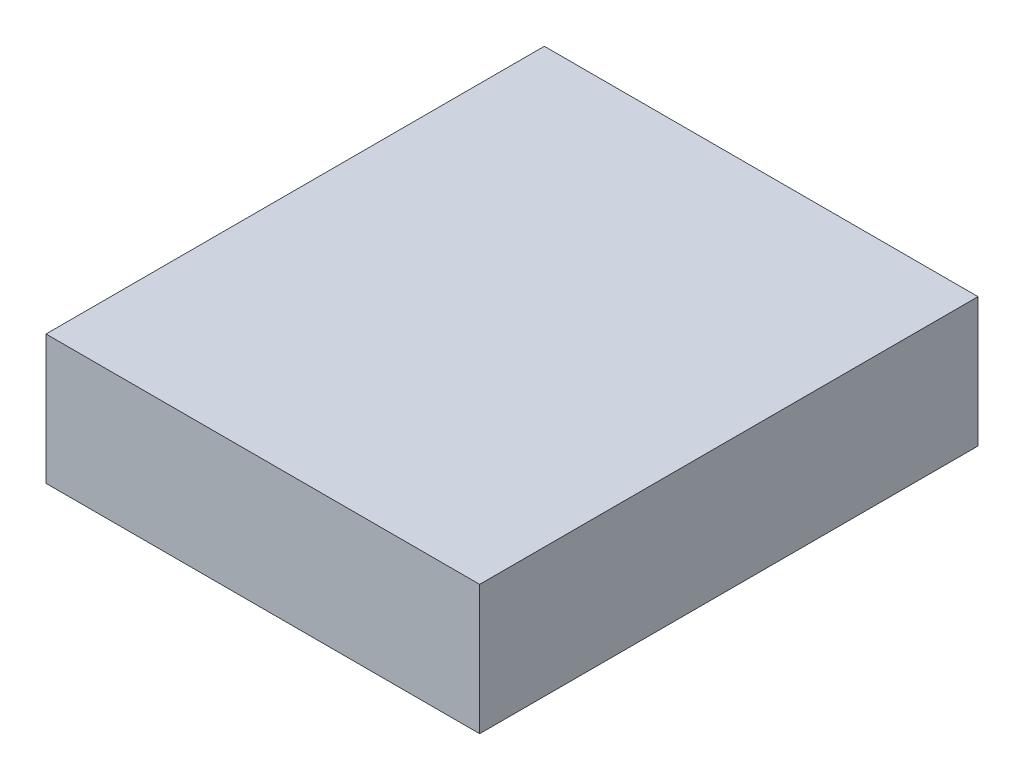
ISO-10303-21;
HEADER;
FILE_DESCRIPTION(('STEP AP214'),'2;1');
FILE_NAME('part.step','',(''),(''),'','','');
FILE_SCHEMA(('AUTOMOTIVE_DESIGN { 1 0 10303 214 1 1 1 1 }'));
ENDSEC;
DATA;
#1=APPLICATION_CONTEXT('core data for automotive mechanical design processes');
#2=APPLICATION_PROTOCOL_DEFINITION('international standard','automotive_design',2000,#1);
#3=PRODUCT_CONTEXT('',#1,'mechanical');
#4=PRODUCT('Part','Part','',(#3));
#5=PRODUCT_RELATED_PRODUCT_CATEGORY('part','',(#4));
#6=PRODUCT_DEFINITION_FORMATION('','',#4);
#7=PRODUCT_DEFINITION_CONTEXT('part definition',#1,'design');
#8=PRODUCT_DEFINITION('design','',#6,#7);
#9=PRODUCT_DEFINITION_SHAPE('','',#8);
#10=(LENGTH_UNIT() NAMED_UNIT(*) SI_UNIT(.MILLI.,.METRE.));
#11=(NAMED_UNIT(*) PLANE_ANGLE_UNIT() SI_UNIT($,.RADIAN.));
#12=(NAMED_UNIT(*) SI_UNIT($,.STERADIAN.) SOLID_ANGLE_UNIT());
#13=UNCERTAINTY_MEASURE_WITH_UNIT(LENGTH_MEASURE(1.E-05),#10,'distance_accuracy_value','');
#14=(GEOMETRIC_REPRESENTATION_CONTEXT(3) GLOBAL_UNCERTAINTY_ASSIGNED_CONTEXT((#13)) GLOBAL_UNIT_ASSIGNED_CONTEXT((#10,
#11,#12)) REPRESENTATION_CONTEXT('',''));
#15=CARTESIAN_POINT('',(0.,0.,0.));
#16=DIRECTION('',(0.,0.,1.));
#17=DIRECTION('',(1.,0.,0.));
#18=AXIS2_PLACEMENT_3D('',#15,#16,#17);
#19=CARTESIAN_POINT('',(49.1336556451419,20.,-2.39991494934085));
#20=DIRECTION('',(1.,0.,0.));
#21=DIRECTION('',(0.,0.,-1.));
#22=AXIS2_PLACEMENT_3D('',#19,#20,#21);
#23=PLANE('',#22);
#24=DIRECTION('',(0.,0.,1.));
#25=VECTOR('',#24,1.);
#26=CARTESIAN_POINT('',(49.1336556451419,30.,-2.39991494934085));
#27=LINE('',#26,#25);
#28=CARTESIAN_POINT('',(49.1336556451419,30.,-79.4472188450339));
#29=VERTEX_POINT('',#28);
#30=CARTESIAN_POINT('',(49.1336556451419,30.,-2.39991494934085));
#31=VERTEX_POINT('',#30);
#32=EDGE_CURVE('E128',#29,#31,#27,.T.);
#33=ORIENTED_EDGE('',*,*,#32,.F.);
#34=DIRECTION('',(0.,1.,0.));
#35=VECTOR('',#34,1.);
#36=CARTESIAN_POINT('',(49.1336556451419,20.,-79.4472188450339));
#37=LINE('',#36,#35);
#38=CARTESIAN_POINT('',(49.1336556451419,50.,-79.4472188450339));
#39=VERTEX_POINT('',#38);
#40=EDGE_CURVE('E256',#29,#39,#37,.T.);
#41=ORIENTED_EDGE('',*,*,#40,.T.);
#42=DIRECTION('',(0.,0.,-1.));
#43=VECTOR('',#42,1.);
#44=CARTESIAN_POINT('',(49.1336556451419,50.,-2.39991494934085));
#45=LINE('',#44,#43);
#46=CARTESIAN_POINT('',(49.1336556451419,50.,-2.39991494934085));
#47=VERTEX_POINT('',#46);
#48=EDGE_CURVE('E289',#47,#39,#45,.T.);
#49=ORIENTED_EDGE('',*,*,#48,.F.);
#50=DIRECTION('',(0.,1.,0.));
#51=VECTOR('',#50,1.);
#52=CARTESIAN_POINT('',(49.1336556451419,20.,-2.39991494934085));
#53=LINE('',#52,#51);
#54=EDGE_CURVE('E260',#31,#47,#53,.T.);
#55=ORIENTED_EDGE('',*,*,#54,.F.);
#56=EDGE_LOOP('',(#33,#41,#49,#55));
#57=FACE_BOUND('',#56,.T.);
#58=ADVANCED_FACE('F40',(#57),#23,.T.);
#59=CARTESIAN_POINT('',(49.1336556451419,20.,-2.39991494934085));
#60=DIRECTION('',(0.,0.,1.));
#61=DIRECTION('',(1.,0.,0.));
#62=AXIS2_PLACEMENT_3D('',#59,#60,#61);
#63=PLANE('',#62);
#64=DIRECTION('',(-1.,0.,0.));
#65=VECTOR('',#64,1.);
#66=CARTESIAN_POINT('',(49.1336556451419,30.,-2.39991494934085));
#67=LINE('',#66,#65);
#68=CARTESIAN_POINT('',(-17.9136482505511,30.,-2.39991494934084));
#69=VERTEX_POINT('',#68);
#70=EDGE_CURVE('E265',#31,#69,#67,.T.);
#71=ORIENTED_EDGE('',*,*,#70,.F.);
#72=ORIENTED_EDGE('',*,*,#54,.T.);
#73=DIRECTION('',(1.,0.,0.));
#74=VECTOR('',#73,1.);
#75=CARTESIAN_POINT('',(49.1336556451419,50.,-2.39991494934085));
#76=LINE('',#75,#74);
#77=CARTESIAN_POINT('',(-17.9136482505511,50.,-2.39991494934084));
#78=VERTEX_POINT('',#77);
#79=EDGE_CURVE('E275',#78,#47,#76,.T.);
#80=ORIENTED_EDGE('',*,*,#79,.F.);
#81=DIRECTION('',(0.,1.,0.));
#82=VECTOR('',#81,1.);
#83=CARTESIAN_POINT('',(-17.9136482505511,20.,-2.39991494934084));
#84=LINE('',#83,#82);
#85=EDGE_CURVE('E276',#69,#78,#84,.T.);
#86=ORIENTED_EDGE('',*,*,#85,.F.);
#87=EDGE_LOOP('',(#71,#72,#80,#86));
#88=FACE_BOUND('',#87,.T.);
#89=ADVANCED_FACE('F240',(#88),#63,.T.);
#90=CARTESIAN_POINT('',(-17.9136482505511,20.,-2.39991494934084));
#91=DIRECTION('',(-1.,0.,0.));
#92=DIRECTION('',(0.,0.,1.));
#93=AXIS2_PLACEMENT_3D('',#90,#91,#92);
#94=PLANE('',#93);
#95=DIRECTION('',(0.,0.,-1.));
#96=VECTOR('',#95,1.);
#97=CARTESIAN_POINT('',(-17.9136482505511,30.,-2.39991494934084));
#98=LINE('',#97,#96);
#99=CARTESIAN_POINT('',(-17.9136482505511,30.,-79.4472188450339));
#100=VERTEX_POINT('',#99);
#101=EDGE_CURVE('E284',#69,#100,#98,.T.);
#102=ORIENTED_EDGE('',*,*,#101,.F.);
#103=ORIENTED_EDGE('',*,*,#85,.T.);
#104=DIRECTION('',(0.,0.,1.));
#105=VECTOR('',#104,1.);
#106=CARTESIAN_POINT('',(-17.9136482505511,50.,-2.39991494934084));
#107=LINE('',#106,#105);
#108=CARTESIAN_POINT('',(-17.9136482505511,50.,-79.4472188450339));
#109=VERTEX_POINT('',#108);
#110=EDGE_CURVE('E279',#109,#78,#107,.T.);
#111=ORIENTED_EDGE('',*,*,#110,.F.);
#112=DIRECTION('',(0.,1.,0.));
#113=VECTOR('',#112,1.);
#114=CARTESIAN_POINT('',(-17.9136482505511,20.,-79.4472188450339));
#115=LINE('',#114,#113);
#116=EDGE_CURVE('E274',#100,#109,#115,.T.);
#117=ORIENTED_EDGE('',*,*,#116,.F.);
#118=EDGE_LOOP('',(#102,#103,#111,#117));
#119=FACE_BOUND('',#118,.T.);
#120=ADVANCED_FACE('F245',(#119),#94,.T.);
#121=CARTESIAN_POINT('',(49.1336556451419,20.,-79.4472188450339));
#122=DIRECTION('',(0.,0.,-1.));
#123=DIRECTION('',(-1.,0.,0.));
#124=AXIS2_PLACEMENT_3D('',#121,#122,#123);
#125=PLANE('',#124);
#126=DIRECTION('',(1.,0.,0.));
#127=VECTOR('',#126,1.);
#128=CARTESIAN_POINT('',(49.1336556451419,30.,-79.4472188450339));
#129=LINE('',#128,#127);
#130=EDGE_CURVE('E43',#100,#29,#129,.T.);
#131=ORIENTED_EDGE('',*,*,#130,.F.);
#132=ORIENTED_EDGE('',*,*,#116,.T.);
#133=DIRECTION('',(-1.,0.,0.));
#134=VECTOR('',#133,1.);
#135=CARTESIAN_POINT('',(49.1336556451419,50.,-79.4472188450339));
#136=LINE('',#135,#134);
#137=EDGE_CURVE('E272',#39,#109,#136,.T.);
#138=ORIENTED_EDGE('',*,*,#137,.F.);
#139=ORIENTED_EDGE('',*,*,#40,.F.);
#140=EDGE_LOOP('',(#131,#132,#138,#139));
#141=FACE_BOUND('',#140,.T.);
#142=ADVANCED_FACE('F269',(#141),#125,.T.);
#143=CARTESIAN_POINT('',(0.,50.,0.));
#144=DIRECTION('',(0.,1.,0.));
#145=DIRECTION('',(0.,0.,1.));
#146=AXIS2_PLACEMENT_3D('',#143,#144,#145);
#147=PLANE('',#146);
#148=ORIENTED_EDGE('',*,*,#48,.T.);
#149=ORIENTED_EDGE('',*,*,#137,.T.);
#150=ORIENTED_EDGE('',*,*,#110,.T.);
#151=ORIENTED_EDGE('',*,*,#79,.T.);
#152=EDGE_LOOP('',(#148,#149,#150,#151));
#153=FACE_BOUND('',#152,.T.);
#154=ADVANCED_FACE('F146',(#153),#147,.T.);
#155=CARTESIAN_POINT('',(-6.91319126641939,40.,-68.4467618609022));
#156=DIRECTION('',(0.,1.,0.));
#157=DIRECTION('',(0.,0.,1.));
#158=AXIS2_PLACEMENT_3D('',#155,#156,#157);
#159=PLANE('',#158);
#160=CARTESIAN_POINT('',(-6.91410516507951,40.,-71.2726681957517));
#161=CARTESIAN_POINT('',(-6.99350375653562,40.,-71.2726683552427));
#162=CARTESIAN_POINT('',(-7.0728961964871,40.,-71.269280741278));
#163=CARTESIAN_POINT('',(-7.23111983019565,40.,-71.2558372766086));
#164=CARTESIAN_POINT('',(-7.30995099225767,40.,-71.2457810523026));
#165=CARTESIAN_POINT('',(-7.46643169742658,40.,-71.2191183349682));
#166=CARTESIAN_POINT('',(-7.54408213255943,40.,-71.2025170710676));
#167=CARTESIAN_POINT('',(-7.69771895369474,40.,-71.1628767594028));
#168=CARTESIAN_POINT('',(-7.77370542838461,40.,-71.1398380556527));
#169=CARTESIAN_POINT('',(-7.92350714506879,40.,-71.0874022796631));
#170=CARTESIAN_POINT('',(-7.99732101346979,40.,-71.0580012790652));
#171=CARTESIAN_POINT('',(-8.14218310243329,40.,-70.9930296777464));
#172=CARTESIAN_POINT('',(-8.21323123096199,40.,-70.9574588719312));
#173=CARTESIAN_POINT('',(-8.35207830370206,40.,-70.8804937852592));
#174=CARTESIAN_POINT('',(-8.41987792137057,40.,-70.8391007184946));
#175=CARTESIAN_POINT('',(-8.55177748489108,40.,-70.7507890609137));
#176=CARTESIAN_POINT('',(-8.61587743128826,40.,-70.7038704709115));
#177=CARTESIAN_POINT('',(-8.73995589691335,40.,-70.6047919985234));
#178=CARTESIAN_POINT('',(-8.79993193230457,40.,-70.5526290031919));
#179=CARTESIAN_POINT('',(-8.91522609834722,40.,-70.4433909556665));
#180=CARTESIAN_POINT('',(-8.97054437858841,40.,-70.3863160613437));
#181=CARTESIAN_POINT('',(-9.07616225198287,40.,-70.2676772092499));
#182=CARTESIAN_POINT('',(-9.12646106272319,40.,-70.2061125542153));
#183=CARTESIAN_POINT('',(-9.22171769602281,40.,-70.0790044497301));
#184=CARTESIAN_POINT('',(-9.26667525401092,40.,-70.0134608034287));
#185=CARTESIAN_POINT('',(-9.39299296003701,40.,-69.8116418723348));
#186=CARTESIAN_POINT('',(-9.46597662208457,40.,-69.669977455296));
#187=CARTESIAN_POINT('',(-9.5868123551977,40.,-69.3764361164516));
#188=CARTESIAN_POINT('',(-9.63467860398487,40.,-69.2245650106258));
#189=CARTESIAN_POINT('',(-9.69261081629481,40.,-68.9677744729264));
#190=CARTESIAN_POINT('',(-9.7099955434211,40.,-68.8644478250843));
#191=CARTESIAN_POINT('',(-9.73322697683256,40.,-68.6566573635956));
#192=CARTESIAN_POINT('',(-9.73909019551389,40.,-68.5521953934485));
#193=CARTESIAN_POINT('',(-9.73909760126894,40.,-68.4476757595647));
#194=B_SPLINE_CURVE_WITH_KNOTS('',3,(#160,#161,#162,#163,#164,#165,#166,#167,#168,#169,#170,
#171,#172,#173,#174,#175,#176,#177,#178,#179,#180,#181,#182,#183,#184,#185,#186,#187,#188,#189,
#190,#191,#192,#193),.UNSPECIFIED.,.F.,.F.,(4,2,2,2,2,2,2,2,2,2,2,2,2,2,2,2,4),(0.,
0.238115313632897,0.476243968530402,0.714182755981982,0.952108830517508,1.19018223225549,
1.42826354945232,1.66629529392513,1.90432700332236,2.14250084593794,2.38066703637684,
2.6188702933212,2.85708534440264,3.33271868177486,3.8080832545841,4.12182342241765,
4.43511361520378),.UNSPECIFIED.);
#195=CARTESIAN_POINT('',(-6.91410516507951,40.,-71.2726681957517));
#196=VERTEX_POINT('',#195);
#197=CARTESIAN_POINT('',(-9.73909760126893,40.,-68.4476757595647));
#198=VERTEX_POINT('',#197);
#199=EDGE_CURVE('E109',#196,#198,#194,.T.);
#200=ORIENTED_EDGE('',*,*,#199,.F.);
#201=DIRECTION('',(1.,0.,0.));
#202=VECTOR('',#201,1.);
#203=CARTESIAN_POINT('',(38.1341125596728,40.,-71.2726681957517));
#204=LINE('',#203,#202);
#205=CARTESIAN_POINT('',(38.1341125596728,40.,-71.2726681957517));
#206=VERTEX_POINT('',#205);
#207=EDGE_CURVE('E104',#206,#196,#204,.F.);
#208=ORIENTED_EDGE('',*,*,#207,.F.);
#209=CARTESIAN_POINT('',(40.9591049958598,40.,-68.4476757595629));
#210=CARTESIAN_POINT('',(40.9591051553509,40.,-68.5270743510192));
#211=CARTESIAN_POINT('',(40.9557175413862,40.,-68.6064667909708));
#212=CARTESIAN_POINT('',(40.9422740767167,40.,-68.7646904246797));
#213=CARTESIAN_POINT('',(40.9322178524107,40.,-68.8435215867418));
#214=CARTESIAN_POINT('',(40.9055551350761,40.,-69.0000022919111));
#215=CARTESIAN_POINT('',(40.8889538711753,40.,-69.0776527270442));
#216=CARTESIAN_POINT('',(40.8493135595101,40.,-69.2312895481799));
#217=CARTESIAN_POINT('',(40.8262748557598,40.,-69.30727602287));
#218=CARTESIAN_POINT('',(40.7738390797699,40.,-69.4570777395546));
#219=CARTESIAN_POINT('',(40.7444380791719,40.,-69.5308916079558));
#220=CARTESIAN_POINT('',(40.679466477853,40.,-69.6757536969197));
#221=CARTESIAN_POINT('',(40.6438956720378,40.,-69.7468018254486));
#222=CARTESIAN_POINT('',(40.5669305853658,40.,-69.885648898189));
#223=CARTESIAN_POINT('',(40.5255375186011,40.,-69.9534485158577));
#224=CARTESIAN_POINT('',(40.4372258610199,40.,-70.0853480793784));
#225=CARTESIAN_POINT('',(40.3903072710176,40.,-70.1494480257756));
#226=CARTESIAN_POINT('',(40.2912287986292,40.,-70.2735264914003));
#227=CARTESIAN_POINT('',(40.2390658032976,40.,-70.333502526791));
#228=CARTESIAN_POINT('',(40.129827755772,40.,-70.4487966928326));
#229=CARTESIAN_POINT('',(40.072752861449,40.,-70.5041149730733));
#230=CARTESIAN_POINT('',(39.9541140093551,40.,-70.6097328464667));
#231=CARTESIAN_POINT('',(39.8925493543204,40.,-70.6600316572066));
#232=CARTESIAN_POINT('',(39.7654412498354,40.,-70.7552882905056));
#233=CARTESIAN_POINT('',(39.6998976035341,40.,-70.8002458484935));
#234=CARTESIAN_POINT('',(39.4980786724396,40.,-70.9265635545201));
#235=CARTESIAN_POINT('',(39.3564142554003,40.,-70.9995472165688));
#236=CARTESIAN_POINT('',(39.0628729165542,40.,-71.1203829496829));
#237=CARTESIAN_POINT('',(38.9110018107274,40.,-71.1682491984699));
#238=CARTESIAN_POINT('',(38.6542112730281,40.,-71.2261814107785));
#239=CARTESIAN_POINT('',(38.5508846251873,40.,-71.2435661379041));
#240=CARTESIAN_POINT('',(38.3430941637011,40.,-71.2667975713148));
#241=CARTESIAN_POINT('',(38.2386321935552,40.,-71.2726607899961));
#242=CARTESIAN_POINT('',(38.1341125596728,40.,-71.2726681957517));
#243=B_SPLINE_CURVE_WITH_KNOTS('',3,(#209,#210,#211,#212,#213,#214,#215,#216,#217,#218,#219,
#220,#221,#222,#223,#224,#225,#226,#227,#228,#229,#230,#231,#232,#233,#234,#235,#236,#237,#238,
#239,#240,#241,#242),.UNSPECIFIED.,.F.,.F.,(4,2,2,2,2,2,2,2,2,2,2,2,2,2,2,2,4),(0.,
0.238115313633369,0.476243968531274,0.714182755983631,0.952108830519971,1.19018223225857,
1.428263549456,1.66629529392926,1.9043270033269,2.1425008459416,2.38066703637962,
2.61887029332326,2.857085344404,3.33271868177922,3.8080832545911,4.12182342242062,
4.43511361520303),.UNSPECIFIED.);
#244=CARTESIAN_POINT('',(40.9591049958598,40.,-68.4476757595629));
#245=VERTEX_POINT('',#244);
#246=EDGE_CURVE('E118',#245,#206,#243,.T.);
#247=ORIENTED_EDGE('',*,*,#246,.F.);
#248=DIRECTION('',(0.,0.,1.));
#249=VECTOR('',#248,1.);
#250=CARTESIAN_POINT('',(40.9591049958598,40.,-13.39945803481));
#251=LINE('',#250,#249);
#252=CARTESIAN_POINT('',(40.9591049958598,40.,-13.39945803481));
#253=VERTEX_POINT('',#252);
#254=EDGE_CURVE('E173',#253,#245,#251,.F.);
#255=ORIENTED_EDGE('',*,*,#254,.F.);
#256=CARTESIAN_POINT('',(38.1341125596713,40.,-10.574465598623));
#257=CARTESIAN_POINT('',(38.2135111511261,40.,-10.5744654391313));
#258=CARTESIAN_POINT('',(38.2929035910764,40.,-10.5778530530955));
#259=CARTESIAN_POINT('',(38.4511272247825,40.,-10.5912965177641));
#260=CARTESIAN_POINT('',(38.5299583868433,40.,-10.6013527420697));
#261=CARTESIAN_POINT('',(38.6864390920098,40.,-10.6280154594034));
#262=CARTESIAN_POINT('',(38.7640895271414,40.,-10.6446167233037));
#263=CARTESIAN_POINT('',(38.9177263482743,40.,-10.6842570349677));
#264=CARTESIAN_POINT('',(38.993712822963,40.,-10.7072957387174));
#265=CARTESIAN_POINT('',(39.1435145396447,40.,-10.7597315147058));
#266=CARTESIAN_POINT('',(39.2173284080444,40.,-10.7891325153029));
#267=CARTESIAN_POINT('',(39.3621904970056,40.,-10.8541041166197));
#268=CARTESIAN_POINT('',(39.4332386255333,40.,-10.8896749224337));
#269=CARTESIAN_POINT('',(39.5720856982715,40.,-10.9666400091031));
#270=CARTESIAN_POINT('',(39.6398853159392,40.,-11.0080330758662));
#271=CARTESIAN_POINT('',(39.7717848794582,40.,-11.0963447334441));
#272=CARTESIAN_POINT('',(39.8358848258548,40.,-11.1432633234447));
#273=CARTESIAN_POINT('',(39.9599632914806,40.,-11.242341795831));
#274=CARTESIAN_POINT('',(40.019939326873,40.,-11.2945047911624));
#275=CARTESIAN_POINT('',(40.135233492918,40.,-11.403742838688));
#276=CARTESIAN_POINT('',(40.1905517731602,40.,-11.460817733011));
#277=CARTESIAN_POINT('',(40.2961696465568,40.,-11.5794565851052));
#278=CARTESIAN_POINT('',(40.3464684572982,40.,-11.6410212401401));
#279=CARTESIAN_POINT('',(40.4417250905998,40.,-11.768129344626));
#280=CARTESIAN_POINT('',(40.486682648589,40.,-11.8336729909277));
#281=CARTESIAN_POINT('',(40.6130003546171,40.,-12.0354919220215));
#282=CARTESIAN_POINT('',(40.6859840166661,40.,-12.1771563390594));
#283=CARTESIAN_POINT('',(40.8068197497816,40.,-12.4706976779029));
#284=CARTESIAN_POINT('',(40.8546859985697,40.,-12.6225687837284));
#285=CARTESIAN_POINT('',(40.9126182108819,40.,-12.8793593214309));
#286=CARTESIAN_POINT('',(40.9300029380093,40.,-12.9826859692764));
#287=CARTESIAN_POINT('',(40.9532343714223,40.,-13.1904764307721));
#288=CARTESIAN_POINT('',(40.9590975901042,40.,-13.2949384009227));
#289=CARTESIAN_POINT('',(40.9591049958598,40.,-13.39945803481));
#290=B_SPLINE_CURVE_WITH_KNOTS('',3,(#256,#257,#258,#259,#260,#261,#262,#263,#264,#265,#266,
#267,#268,#269,#270,#271,#272,#273,#274,#275,#276,#277,#278,#279,#280,#281,#282,#283,#284,#285,
#286,#287,#288,#289),.UNSPECIFIED.,.F.,.F.,(4,2,2,2,2,2,2,2,2,2,2,2,2,2,2,2,4),(0.,
0.238115313629191,0.476243968522861,0.714182755970647,0.952108830502411,1.19018223223602,
1.42826354942849,1.66629529389697,1.90432700328985,2.14250084590806,2.38066703634959,
2.61887029329659,2.85708534438068,3.33271868175286,3.80808325456203,4.1218234224062,
4.43511361520301),.UNSPECIFIED.);
#291=CARTESIAN_POINT('',(38.1341125596713,40.,-10.574465598623));
#292=VERTEX_POINT('',#291);
#293=EDGE_CURVE('E165',#292,#253,#290,.T.);
#294=ORIENTED_EDGE('',*,*,#293,.F.);
#295=DIRECTION('',(-1.,0.,0.));
#296=VECTOR('',#295,1.);
#297=CARTESIAN_POINT('',(-6.91410516508194,40.,-10.574465598623));
#298=LINE('',#297,#296);
#299=CARTESIAN_POINT('',(-6.91410516508194,40.,-10.574465598623));
#300=VERTEX_POINT('',#299);
#301=EDGE_CURVE('E174',#300,#292,#298,.F.);
#302=ORIENTED_EDGE('',*,*,#301,.F.);
#303=CARTESIAN_POINT('',(-9.73909760126894,40.,-13.3994580348115));
#304=CARTESIAN_POINT('',(-9.73909776076061,40.,-13.3200594433567));
#305=CARTESIAN_POINT('',(-9.73571014679644,40.,-13.2406670034064));
#306=CARTESIAN_POINT('',(-9.72226668212796,40.,-13.0824433697003));
#307=CARTESIAN_POINT('',(-9.71221045782239,40.,-13.0036122076395));
#308=CARTESIAN_POINT('',(-9.68554774048873,40.,-12.8471315024731));
#309=CARTESIAN_POINT('',(-9.66894647658847,40.,-12.7694810673415));
#310=CARTESIAN_POINT('',(-9.6293061649245,40.,-12.6158442462086));
#311=CARTESIAN_POINT('',(-9.60626746117482,40.,-12.5398577715199));
#312=CARTESIAN_POINT('',(-9.55383168518632,40.,-12.3900560548382));
#313=CARTESIAN_POINT('',(-9.52443068458913,40.,-12.3162421864386));
#314=CARTESIAN_POINT('',(-9.45945908327216,40.,-12.1713800974775));
#315=CARTESIAN_POINT('',(-9.42388827745816,40.,-12.1003319689499));
#316=CARTESIAN_POINT('',(-9.34692319078882,40.,-11.9614848962117));
#317=CARTESIAN_POINT('',(-9.30553012402571,40.,-11.893685278544));
#318=CARTESIAN_POINT('',(-9.21721846644789,40.,-11.7617857150249));
#319=CARTESIAN_POINT('',(-9.1702998764474,40.,-11.6976857686284));
#320=CARTESIAN_POINT('',(-9.07122140406103,40.,-11.5736073030023));
#321=CARTESIAN_POINT('',(-9.01905840872941,40.,-11.5136312676097));
#322=CARTESIAN_POINT('',(-8.90982036120351,40.,-11.3983371015644));
#323=CARTESIAN_POINT('',(-8.85274546688026,40.,-11.343018821322));
#324=CARTESIAN_POINT('',(-8.73410661478561,40.,-11.2374009479251));
#325=CARTESIAN_POINT('',(-8.67254195975049,40.,-11.1871021371836));
#326=CARTESIAN_POINT('',(-8.54543385526415,40.,-11.0918455038817));
#327=CARTESIAN_POINT('',(-8.47989020896217,40.,-11.0468879458924));
#328=CARTESIAN_POINT('',(-8.27807127786825,40.,-10.9205702398644));
#329=CARTESIAN_POINT('',(-8.13640686083028,40.,-10.8475865778157));
#330=CARTESIAN_POINT('',(-7.84286552198713,40.,-10.7267508447005));
#331=CARTESIAN_POINT('',(-7.69099441616189,40.,-10.6788845959122));
#332=CARTESIAN_POINT('',(-7.43420387845992,40.,-10.6209523835996));
#333=CARTESIAN_POINT('',(-7.33087723061466,40.,-10.6035676564722));
#334=CARTESIAN_POINT('',(-7.12308676911946,40.,-10.5803362230593));
#335=CARTESIAN_POINT('',(-7.01862479896903,40.,-10.5744730043777));
#336=CARTESIAN_POINT('',(-6.91410516508194,40.,-10.574465598623));
#337=B_SPLINE_CURVE_WITH_KNOTS('',3,(#303,#304,#305,#306,#307,#308,#309,#310,#311,#312,#313,
#314,#315,#316,#317,#318,#319,#320,#321,#322,#323,#324,#325,#326,#327,#328,#329,#330,#331,#332,
#333,#334,#335,#336),.UNSPECIFIED.,.F.,.F.,(4,2,2,2,2,2,2,2,2,2,2,2,2,2,2,2,4),(0.,
0.238115313629141,0.476243968522806,0.714182755970556,0.952108830502276,1.19018223223582,
1.42826354942823,1.66629529389666,1.90432700328947,2.14250084590844,2.38066703635075,
2.61887029329855,2.85708534438341,3.33271868175514,3.80808325456376,4.12182342240713,
4.43511361520324),.UNSPECIFIED.);
#338=CARTESIAN_POINT('',(-9.73909760126894,40.,-13.3994580348115));
#339=VERTEX_POINT('',#338);
#340=EDGE_CURVE('E125',#339,#300,#337,.T.);
#341=ORIENTED_EDGE('',*,*,#340,.F.);
#342=DIRECTION('',(0.,0.,-1.));
#343=VECTOR('',#342,1.);
#344=CARTESIAN_POINT('',(-9.73909760126893,40.,-68.4476757595647));
#345=LINE('',#344,#343);
#346=EDGE_CURVE('E123',#198,#339,#345,.F.);
#347=ORIENTED_EDGE('',*,*,#346,.F.);
#348=EDGE_LOOP('',(#200,#208,#247,#255,#294,#302,#341,#347));
#349=FACE_BOUND('',#348,.T.);
#350=ADVANCED_FACE('F120',(#349),#159,.F.);
#351=CARTESIAN_POINT('',(41.133655645142,30.,-68.4476757595647));
#352=CARTESIAN_POINT('',(41.1336556451379,30.,-68.840429334724));
#353=CARTESIAN_POINT('',(41.0555924334468,30.,-69.232863053447));
#354=CARTESIAN_POINT('',(40.7551013310811,30.,-69.9583774615525));
#355=CARTESIAN_POINT('',(40.5327915632192,30.,-70.2911020937121));
#356=CARTESIAN_POINT('',(39.9775388938187,30.,-70.8463547631098));
#357=CARTESIAN_POINT('',(39.6448142616591,30.,-71.0686645309718));
#358=CARTESIAN_POINT('',(38.9192998535564,30.,-71.3691556333401));
#359=CARTESIAN_POINT('',(38.526866134831,30.,-71.4472188450285));
#360=CARTESIAN_POINT('',(38.1341125596728,30.,-71.4472188450339));
#361=CARTESIAN_POINT('',(40.9241948660033,42.,-68.4476757595647));
#362=CARTESIAN_POINT('',(40.9241948659952,42.,-68.8130114890397));
#363=CARTESIAN_POINT('',(40.8515814038707,42.0000000000007,-69.1780441144978));
#364=CARTESIAN_POINT('',(40.5720742517307,41.9999999999993,-69.8528942663048));
#365=CARTESIAN_POINT('',(40.3652905781197,42.,-70.1623808041685));
#366=CARTESIAN_POINT('',(39.8488176042752,42.,-70.6788537780103));
#367=CARTESIAN_POINT('',(39.5393310664101,41.9999999999993,-70.88563745162));
#368=CARTESIAN_POINT('',(38.8644809146086,42.0000000000007,-71.1651446037654));
#369=CARTESIAN_POINT('',(38.4994482891457,42.,-71.2377580658871));
#370=CARTESIAN_POINT('',(38.1341125596728,42.,-71.2377580658953));
#371=B_SPLINE_SURFACE_WITH_KNOTS('',1,3,((#351,#352,#353,#354,#355,#356,#357,#358,#359,#360),
(#361,#362,#363,#364,#365,#366,#367,#368,#369,#370)),.UNSPECIFIED.,.F.,.F.,.F.,(2,2),(4,2,2,2,
4),(0.,1.),(2.35634678343993,2.74896971851486,3.1415926535898,3.53421558866473,
3.92683852373967),.UNSPECIFIED.);
#372=CARTESIAN_POINT('',(41.133655645142,30.,-68.4476757595647));
#373=CARTESIAN_POINT('',(41.1336558119914,30.,-68.5319658626972));
#374=CARTESIAN_POINT('',(41.1300600356214,30.,-68.616249433284));
#375=CARTESIAN_POINT('',(41.1157905266406,30.,-68.7842209209011));
#376=CARTESIAN_POINT('',(41.1051163987735,30.,-68.8679088044043));
#377=CARTESIAN_POINT('',(41.0768154369499,30.,-69.0340304873919));
#378=CARTESIAN_POINT('',(41.0591941569987,30.,-69.1164652341734));
#379=CARTESIAN_POINT('',(41.0171182809386,30.,-69.2795687384406));
#380=CARTESIAN_POINT('',(40.992664049219,30.,-69.3602375898509));
#381=CARTESIAN_POINT('',(40.9370066127241,30.,-69.5192710375931));
#382=CARTESIAN_POINT('',(40.905799243035,30.,-69.5976341778736));
#383=CARTESIAN_POINT('',(40.8368356819061,30.,-69.7514253513387));
#384=CARTESIAN_POINT('',(40.7990792736805,30.,-69.8268532872612));
#385=CARTESIAN_POINT('',(40.7173849598095,30.,-69.9742609730422));
#386=CARTESIAN_POINT('',(40.6734483374239,30.,-70.0462414345858));
#387=CARTESIAN_POINT('',(40.5797098260698,30.,-70.1862760592701));
#388=CARTESIAN_POINT('',(40.5299079364488,30.,-70.2543302219742));
#389=CARTESIAN_POINT('',(40.4247313813518,30.,-70.3860761455473));
#390=CARTESIAN_POINT('',(40.3693524490669,30.,-70.4497645027107));
#391=CARTESIAN_POINT('',(40.2533785374611,30.,-70.5721961903659));
#392=CARTESIAN_POINT('',(40.1927837258668,30.,-70.6309396797497));
#393=CARTESIAN_POINT('',(40.0668269466108,30.,-70.7430983254904));
#394=CARTESIAN_POINT('',(40.0014642379522,30.,-70.7965126505545));
#395=CARTESIAN_POINT('',(39.8665135226686,30.,-70.8976707701872));
#396=CARTESIAN_POINT('',(39.7969253065697,30.,-70.9454142832854));
#397=CARTESIAN_POINT('',(39.5826505755119,30.,-71.079562372254));
#398=CARTESIAN_POINT('',(39.4322409271368,30.,-71.1570735915699));
#399=CARTESIAN_POINT('',(39.1205747854156,30.,-71.2854124600779));
#400=CARTESIAN_POINT('',(38.9593244630481,30.,-71.3362551474581));
#401=CARTESIAN_POINT('',(38.6866191304976,30.,-71.3978100747169));
#402=CARTESIAN_POINT('',(38.5768550281473,30.,-71.4162874604368));
#403=CARTESIAN_POINT('',(38.3561172491338,30.,-71.4409791299788));
#404=CARTESIAN_POINT('',(38.2451455308417,30.,-71.4472109460927));
#405=CARTESIAN_POINT('',(38.1341125596728,30.,-71.4472188450339));
#406=B_SPLINE_CURVE_WITH_KNOTS('',3,(#372,#373,#374,#375,#376,#377,#378,#379,#380,#381,#382,
#383,#384,#385,#386,#387,#388,#389,#390,#391,#392,#393,#394,#395,#396,#397,#398,#399,#400,#401,
#402,#403,#404,#405),.UNSPECIFIED.,.F.,.F.,(4,2,2,2,2,2,2,2,2,2,2,2,2,2,2,2,4),(0.,
0.252784911160667,0.505583939053283,0.758181271453938,1.01076513585331,1.26350522445495,
1.51625368083791,1.7689497337854,2.02164581484531,2.27453671552216,2.52741948703232,
2.78034164407849,3.0332763496517,3.53830173029577,4.04304202387495,4.37633286296178,
4.70914617243502),.UNSPECIFIED.);
#407=CARTESIAN_POINT('',(41.133655645142,30.,-68.4476757595647));
#408=VERTEX_POINT('',#407);
#409=CARTESIAN_POINT('',(38.1341125596728,30.,-71.4472188450339));
#410=VERTEX_POINT('',#409);
#411=EDGE_CURVE('E117',#408,#410,#406,.T.);
#412=DIRECTION('',(0.0174524064372834,-0.999847695156391,-1.81610399319171E-13));
#413=VECTOR('',#412,1.);
#414=CARTESIAN_POINT('',(41.133655645142,30.,-68.4476757595647));
#415=LINE('',#414,#413);
#416=EDGE_CURVE('E314',#245,#408,#415,.T.);
#417=DIRECTION('',(0.,-0.999847695156391,-0.0174524064372835));
#418=VECTOR('',#417,1.);
#419=CARTESIAN_POINT('',(38.1341125596728,30.,-71.4472188450339));
#420=LINE('',#419,#418);
#421=EDGE_CURVE('E115',#206,#410,#420,.T.);
#422=ORIENTED_EDGE('',*,*,#411,.F.);
#423=ORIENTED_EDGE('',*,*,#416,.F.);
#424=ORIENTED_EDGE('',*,*,#246,.T.);
#425=ORIENTED_EDGE('',*,*,#421,.T.);
#426=EDGE_LOOP('',(#422,#423,#424,#425));
#427=FACE_BOUND('',#426,.T.);
#428=ADVANCED_FACE('F145',(#427),#371,.T.);
#429=CARTESIAN_POINT('',(41.1336556451419,30.,-13.39945803481));
#430=DIRECTION('',(0.999847695156391,0.0174524064372835,0.));
#431=DIRECTION('',(-0.0174524064372835,0.999847695156391,0.));
#432=AXIS2_PLACEMENT_3D('',#429,#430,#431);
#433=PLANE('',#432);
#434=DIRECTION('',(0.,0.,-1.));
#435=VECTOR('',#434,1.);
#436=CARTESIAN_POINT('',(41.1336556451419,30.,-13.39945803481));
#437=LINE('',#436,#435);
#438=CARTESIAN_POINT('',(41.133655645142,30.,-13.39945803481));
#439=VERTEX_POINT('',#438);
#440=EDGE_CURVE('E317',#439,#408,#437,.T.);
#441=ORIENTED_EDGE('',*,*,#440,.F.);
#442=DIRECTION('',(0.0174524064372835,-0.999847695156391,0.));
#443=VECTOR('',#442,1.);
#444=CARTESIAN_POINT('',(41.1336556451419,30.,-13.39945803481));
#445=LINE('',#444,#443);
#446=EDGE_CURVE('E201',#253,#439,#445,.T.);
#447=ORIENTED_EDGE('',*,*,#446,.F.);
#448=ORIENTED_EDGE('',*,*,#254,.T.);
#449=ORIENTED_EDGE('',*,*,#416,.T.);
#450=EDGE_LOOP('',(#441,#447,#448,#449));
#451=FACE_BOUND('',#450,.T.);
#452=ADVANCED_FACE('F182',(#451),#433,.F.);
#453=CARTESIAN_POINT('',(38.1341125596728,30.,-10.3999149493408));
#454=CARTESIAN_POINT('',(38.5268661348311,30.,-10.3999149493443));
#455=CARTESIAN_POINT('',(38.9192998535564,30.,-10.4779781610353));
#456=CARTESIAN_POINT('',(39.6448142616591,30.,-10.7784692634023));
#457=CARTESIAN_POINT('',(39.9775388938187,30.,-11.0007790312643));
#458=CARTESIAN_POINT('',(40.5327915632192,30.,-11.5560317006634));
#459=CARTESIAN_POINT('',(40.7551013310798,30.,-11.8887563328233));
#460=CARTESIAN_POINT('',(41.0555924334481,30.,-12.6142707409268));
#461=CARTESIAN_POINT('',(41.1336556451379,30.,-13.0067044596515));
#462=CARTESIAN_POINT('',(41.133655645142,30.,-13.39945803481));
#463=CARTESIAN_POINT('',(38.1341125596728,42.,-10.6093757284795));
#464=CARTESIAN_POINT('',(38.4994482891467,42.,-10.6093757284842));
#465=CARTESIAN_POINT('',(38.8644809146072,42.0000000000007,-10.681989190611));
#466=CARTESIAN_POINT('',(39.5393310664115,41.9999999999993,-10.9614963427531));
#467=CARTESIAN_POINT('',(39.8488176042752,42.,-11.1682800163634));
#468=CARTESIAN_POINT('',(40.3652905781197,42.,-11.6847529902073));
#469=CARTESIAN_POINT('',(40.5720742517294,41.9999999999993,-11.9942395280716));
#470=CARTESIAN_POINT('',(40.8515814038721,42.0000000000007,-12.6690896798752));
#471=CARTESIAN_POINT('',(40.9241948659952,42.,-13.0341223053363));
#472=CARTESIAN_POINT('',(40.9241948660033,42.,-13.39945803481));
#473=B_SPLINE_SURFACE_WITH_KNOTS('',1,3,((#453,#454,#455,#456,#457,#458,#459,#460,#461,#462),
(#463,#464,#465,#466,#467,#468,#469,#470,#471,#472)),.UNSPECIFIED.,.F.,.F.,.F.,(2,2),(4,2,2,2,
4),(0.,1.),(2.35634678343992,2.74896971851486,3.14159265358979,3.53421558866473,
3.92683852373966),.UNSPECIFIED.);
#474=CARTESIAN_POINT('',(38.1341125596728,30.,-10.3999149493408));
#475=CARTESIAN_POINT('',(38.2184026628047,30.,-10.3999147824913));
#476=CARTESIAN_POINT('',(38.3026862333909,30.,-10.4035105588611));
#477=CARTESIAN_POINT('',(38.4706577210068,30.,-10.4177800678416));
#478=CARTESIAN_POINT('',(38.5543456045095,30.,-10.4284541957084));
#479=CARTESIAN_POINT('',(38.7204672874959,30.,-10.4567551575316));
#480=CARTESIAN_POINT('',(38.8029020342768,30.,-10.4743764374825));
#481=CARTESIAN_POINT('',(38.9660055385427,30.,-10.5164523135419));
#482=CARTESIAN_POINT('',(39.0466743899525,30.,-10.5409065452612));
#483=CARTESIAN_POINT('',(39.2057078376934,30.,-10.5965639817555));
#484=CARTESIAN_POINT('',(39.2840709779733,30.,-10.6277713514444));
#485=CARTESIAN_POINT('',(39.4378621514372,30.,-10.6967349125726));
#486=CARTESIAN_POINT('',(39.5132900873591,30.,-10.7344913207978));
#487=CARTESIAN_POINT('',(39.6606977731392,30.,-10.8161856346678));
#488=CARTESIAN_POINT('',(39.7326782346823,30.,-10.8601222570529));
#489=CARTESIAN_POINT('',(39.872712859366,30.,-10.9538607684056));
#490=CARTESIAN_POINT('',(39.9407670220698,30.,-11.0036626580259));
#491=CARTESIAN_POINT('',(40.0725129456437,30.,-11.1088392131221));
#492=CARTESIAN_POINT('',(40.136201302808,30.,-11.164218145407));
#493=CARTESIAN_POINT('',(40.2586329904652,30.,-11.280192057013));
#494=CARTESIAN_POINT('',(40.3173764798499,30.,-11.3407868686073));
#495=CARTESIAN_POINT('',(40.4295351255923,30.,-11.4667436478637));
#496=CARTESIAN_POINT('',(40.4829494506572,30.,-11.5321063565227));
#497=CARTESIAN_POINT('',(40.5841075702911,30.,-11.6670570718072));
#498=CARTESIAN_POINT('',(40.6318510833899,30.,-11.7366452879066));
#499=CARTESIAN_POINT('',(40.7659991723584,30.,-11.9509200189637));
#500=CARTESIAN_POINT('',(40.8435103916738,30.,-12.1013296673374));
#501=CARTESIAN_POINT('',(40.9718492601818,30.,-12.4129958090557));
#502=CARTESIAN_POINT('',(41.0226919475625,30.,-12.5742461314216));
#503=CARTESIAN_POINT('',(41.0842468748233,30.,-12.8469514639728));
#504=CARTESIAN_POINT('',(41.1027242605441,30.,-12.9567155663255));
#505=CARTESIAN_POINT('',(41.1274159300871,30.,-13.177453345344));
#506=CARTESIAN_POINT('',(41.1336477462012,30.,-13.2884250636386));
#507=CARTESIAN_POINT('',(41.133655645142,30.,-13.39945803481));
#508=B_SPLINE_CURVE_WITH_KNOTS('',3,(#474,#475,#476,#477,#478,#479,#480,#481,#482,#483,#484,
#485,#486,#487,#488,#489,#490,#491,#492,#493,#494,#495,#496,#497,#498,#499,#500,#501,#502,#503,
#504,#505,#506,#507),.UNSPECIFIED.,.F.,.F.,(4,2,2,2,2,2,2,2,2,2,2,2,2,2,2,2,4),(0.,
0.252784911158893,0.505583939049778,0.758181271448439,1.0107651358458,1.26350522444539,
1.51625368082631,1.76894973377185,2.02164581482983,2.2745367155089,2.52741948702129,
2.7803416440696,3.03327634964497,3.5383017302849,4.04304202386006,4.37633286295446,
4.70914617243519),.UNSPECIFIED.);
#509=CARTESIAN_POINT('',(38.1341125596728,30.,-10.3999149493408));
#510=VERTEX_POINT('',#509);
#511=EDGE_CURVE('E191',#510,#439,#508,.T.);
#512=DIRECTION('',(1.5139338890652E-13,-0.999847695156391,0.0174524064372835));
#513=VECTOR('',#512,1.);
#514=CARTESIAN_POINT('',(38.1341125596728,30.,-10.3999149493408));
#515=LINE('',#514,#513);
#516=EDGE_CURVE('E200',#292,#510,#515,.T.);
#517=ORIENTED_EDGE('',*,*,#511,.F.);
#518=ORIENTED_EDGE('',*,*,#516,.F.);
#519=ORIENTED_EDGE('',*,*,#293,.T.);
#520=ORIENTED_EDGE('',*,*,#446,.T.);
#521=EDGE_LOOP('',(#517,#518,#519,#520));
#522=FACE_BOUND('',#521,.T.);
#523=ADVANCED_FACE('F175',(#522),#473,.T.);
#524=CARTESIAN_POINT('',(-6.91410516508194,30.,-10.3999149493409));
#525=DIRECTION('',(0.,0.0174524064372835,0.999847695156391));
#526=DIRECTION('',(0.,-0.999847695156391,0.0174524064372835));
#527=AXIS2_PLACEMENT_3D('',#524,#525,#526);
#528=PLANE('',#527);
#529=DIRECTION('',(1.,0.,0.));
#530=VECTOR('',#529,1.);
#531=CARTESIAN_POINT('',(-6.91410516508194,30.,-10.3999149493409));
#532=LINE('',#531,#530);
#533=CARTESIAN_POINT('',(-6.91410516508194,30.,-10.3999149493408));
#534=VERTEX_POINT('',#533);
#535=EDGE_CURVE('E328',#534,#510,#532,.T.);
#536=ORIENTED_EDGE('',*,*,#535,.F.);
#537=DIRECTION('',(0.,-0.999847695156391,0.0174524064372835));
#538=VECTOR('',#537,1.);
#539=CARTESIAN_POINT('',(-6.91410516508194,30.,-10.3999149493409));
#540=LINE('',#539,#538);
#541=EDGE_CURVE('E215',#300,#534,#540,.T.);
#542=ORIENTED_EDGE('',*,*,#541,.F.);
#543=ORIENTED_EDGE('',*,*,#301,.T.);
#544=ORIENTED_EDGE('',*,*,#516,.T.);
#545=EDGE_LOOP('',(#536,#542,#543,#544));
#546=FACE_BOUND('',#545,.T.);
#547=ADVANCED_FACE('F181',(#546),#528,.F.);
#548=CARTESIAN_POINT('',(-9.91364825055111,30.,-13.39945803481));
#549=CARTESIAN_POINT('',(-9.91364825054771,30.,-13.0067044596517));
#550=CARTESIAN_POINT('',(-9.83558503885696,30.,-12.6142707409264));
#551=CARTESIAN_POINT('',(-9.53509393648928,30.,-11.8887563328237));
#552=CARTESIAN_POINT('',(-9.31278416862803,30.,-11.5560317006637));
#553=CARTESIAN_POINT('',(-8.75753149922824,30.,-11.0007790312639));
#554=CARTESIAN_POINT('',(-8.42480686706829,30.,-10.7784692634023));
#555=CARTESIAN_POINT('',(-7.69929245896553,30.,-10.4779781610353));
#556=CARTESIAN_POINT('',(-7.30685874024021,30.,-10.3999149493443));
#557=CARTESIAN_POINT('',(-6.91410516508194,30.,-10.3999149493408));
#558=CARTESIAN_POINT('',(-9.7041874714125,42.,-13.39945803481));
#559=CARTESIAN_POINT('',(-9.70418747140773,42.,-13.0341223053366));
#560=CARTESIAN_POINT('',(-9.63157400928126,42.0000000000007,-12.6690896798749));
#561=CARTESIAN_POINT('',(-9.35206685713851,41.9999999999993,-11.994239528072));
#562=CARTESIAN_POINT('',(-9.14528318352856,42.,-11.6847529902077));
#563=CARTESIAN_POINT('',(-8.62881020968464,42.,-11.1682800163631));
#564=CARTESIAN_POINT('',(-8.31932367181998,41.9999999999993,-10.9614963427531));
#565=CARTESIAN_POINT('',(-7.64447352001708,42.0000000000007,-10.681989190611));
#566=CARTESIAN_POINT('',(-7.27944089455539,42.,-10.6093757284842));
#567=CARTESIAN_POINT('',(-6.91410516508194,42.,-10.6093757284795));
#568=B_SPLINE_SURFACE_WITH_KNOTS('',1,3,((#548,#549,#550,#551,#552,#553,#554,#555,#556,#557),
(#558,#559,#560,#561,#562,#563,#564,#565,#566,#567)),.UNSPECIFIED.,.F.,.F.,.F.,(2,2),(4,2,2,2,
4),(0.,1.),(2.35634678343993,2.74896971851486,3.14159265358979,3.53421558866473,
3.92683852373966),.UNSPECIFIED.);
#569=CARTESIAN_POINT('',(-9.91364825055111,30.,-13.39945803481));
#570=CARTESIAN_POINT('',(-9.91364841740064,30.,-13.3151679316781));
#571=CARTESIAN_POINT('',(-9.9100526410309,30.,-13.2308843610918));
#572=CARTESIAN_POINT('',(-9.89578313205042,30.,-13.0629128734758));
#573=CARTESIAN_POINT('',(-9.88510900418358,30.,-12.9792249899731));
#574=CARTESIAN_POINT('',(-9.85680804236042,30.,-12.8131033069867));
#575=CARTESIAN_POINT('',(-9.83918676240956,30.,-12.7306685602057));
#576=CARTESIAN_POINT('',(-9.79711088635007,30.,-12.5675650559397));
#577=CARTESIAN_POINT('',(-9.77265665463074,30.,-12.4868962045299));
#578=CARTESIAN_POINT('',(-9.71699921813632,30.,-12.3278627567889));
#579=CARTESIAN_POINT('',(-9.68579184844738,30.,-12.2494996165091));
#580=CARTESIAN_POINT('',(-9.61682828731904,30.,-12.0957084430451));
#581=CARTESIAN_POINT('',(-9.57907187909383,30.,-12.0202805071232));
#582=CARTESIAN_POINT('',(-9.4973775652238,30.,-11.872872821343));
#583=CARTESIAN_POINT('',(-9.45344094283874,30.,-11.8008923597999));
#584=CARTESIAN_POINT('',(-9.35970243148597,30.,-11.6608577351161));
#585=CARTESIAN_POINT('',(-9.30990054186574,30.,-11.5928035724123));
#586=CARTESIAN_POINT('',(-9.20472398676942,30.,-11.4610576488383));
#587=CARTESIAN_POINT('',(-9.1493450544844,30.,-11.3973692916739));
#588=CARTESIAN_POINT('',(-9.03337114287807,30.,-11.2749376040167));
#589=CARTESIAN_POINT('',(-8.97277633128356,30.,-11.2161941146319));
#590=CARTESIAN_POINT('',(-8.84681955202673,30.,-11.1040354688895));
#591=CARTESIAN_POINT('',(-8.78145684336769,30.,-11.0506211438245));
#592=CARTESIAN_POINT('',(-8.64650612808294,30.,-10.9494630241905));
#593=CARTESIAN_POINT('',(-8.57691791198339,30.,-10.9017195110916));
#594=CARTESIAN_POINT('',(-8.36264318092588,30.,-10.767571422123));
#595=CARTESIAN_POINT('',(-8.21223353255183,30.,-10.6900602028076));
#596=CARTESIAN_POINT('',(-7.9005673908328,30.,-10.5617213342998));
#597=CARTESIAN_POINT('',(-7.73931706846656,30.,-10.5108786469193));
#598=CARTESIAN_POINT('',(-7.46661173591566,30.,-10.4493237196589));
#599=CARTESIAN_POINT('',(-7.35684763356362,30.,-10.4308463339382));
#600=CARTESIAN_POINT('',(-7.13610985454657,30.,-10.4061546643954));
#601=CARTESIAN_POINT('',(-7.02513813625265,30.,-10.3999228482814));
#602=CARTESIAN_POINT('',(-6.91410516508194,30.,-10.3999149493408));
#603=B_SPLINE_CURVE_WITH_KNOTS('',3,(#569,#570,#571,#572,#573,#574,#575,#576,#577,#578,#579,
#580,#581,#582,#583,#584,#585,#586,#587,#588,#589,#590,#591,#592,#593,#594,#595,#596,#597,#598,
#599,#600,#601,#602),.UNSPECIFIED.,.F.,.F.,(4,2,2,2,2,2,2,2,2,2,2,2,2,2,2,2,4),(0.,
0.252784911158993,0.505583939050002,0.758181271448793,1.01076513584627,1.26350522444595,
1.51625368082696,1.7689497337726,2.02164581483066,2.27453671551015,2.52741948702297,
2.78034164407171,3.0332763496475,3.5383017302883,4.04304202386433,4.37633286295662,
4.70914617243523),.UNSPECIFIED.);
#604=CARTESIAN_POINT('',(-9.91364825055111,30.,-13.39945803481));
#605=VERTEX_POINT('',#604);
#606=EDGE_CURVE('E206',#605,#534,#603,.T.);
#607=DIRECTION('',(-0.0174524064372835,-0.999847695156391,1.5139338890652E-13));
#608=VECTOR('',#607,1.);
#609=CARTESIAN_POINT('',(-9.91364825055111,30.,-13.39945803481));
#610=LINE('',#609,#608);
#611=EDGE_CURVE('E214',#339,#605,#610,.T.);
#612=ORIENTED_EDGE('',*,*,#606,.F.);
#613=ORIENTED_EDGE('',*,*,#611,.F.);
#614=ORIENTED_EDGE('',*,*,#340,.T.);
#615=ORIENTED_EDGE('',*,*,#541,.T.);
#616=EDGE_LOOP('',(#612,#613,#614,#615));
#617=FACE_BOUND('',#616,.T.);
#618=ADVANCED_FACE('F221',(#617),#568,.T.);
#619=CARTESIAN_POINT('',(-9.91364825055111,30.,-68.4476757595647));
#620=DIRECTION('',(-0.999847695156391,0.0174524064372835,0.));
#621=DIRECTION('',(-0.0174524064372835,-0.999847695156391,0.));
#622=AXIS2_PLACEMENT_3D('',#619,#620,#621);
#623=PLANE('',#622);
#624=DIRECTION('',(0.,0.,1.));
#625=VECTOR('',#624,1.);
#626=CARTESIAN_POINT('',(-9.91364825055111,30.,-68.4476757595647));
#627=LINE('',#626,#625);
#628=CARTESIAN_POINT('',(-9.91364825055111,30.,-68.4476757595647));
#629=VERTEX_POINT('',#628);
#630=EDGE_CURVE('E335',#629,#605,#627,.T.);
#631=ORIENTED_EDGE('',*,*,#630,.F.);
#632=DIRECTION('',(-0.0174524064372835,-0.999847695156391,0.));
#633=VECTOR('',#632,1.);
#634=CARTESIAN_POINT('',(-9.91364825055111,30.,-68.4476757595647));
#635=LINE('',#634,#633);
#636=EDGE_CURVE('E339',#198,#629,#635,.T.);
#637=ORIENTED_EDGE('',*,*,#636,.F.);
#638=ORIENTED_EDGE('',*,*,#346,.T.);
#639=ORIENTED_EDGE('',*,*,#611,.T.);
#640=EDGE_LOOP('',(#631,#637,#638,#639));
#641=FACE_BOUND('',#640,.T.);
#642=ADVANCED_FACE('F226',(#641),#623,.F.);
#643=CARTESIAN_POINT('',(-6.91410516508194,30.,-71.4472188450339));
#644=CARTESIAN_POINT('',(-7.30685874024021,30.,-71.4472188450284));
#645=CARTESIAN_POINT('',(-7.69929245896552,30.,-71.3691556333374));
#646=CARTESIAN_POINT('',(-8.42480686706829,30.,-71.0686645309744));
#647=CARTESIAN_POINT('',(-8.75753149922823,30.,-70.8463547631098));
#648=CARTESIAN_POINT('',(-9.31278416862802,30.,-70.291102093712));
#649=CARTESIAN_POINT('',(-9.53509393648928,30.,-69.9583774615524));
#650=CARTESIAN_POINT('',(-9.83558503885696,30.,-69.232863053447));
#651=CARTESIAN_POINT('',(-9.91364825054634,30.,-68.840429334724));
#652=CARTESIAN_POINT('',(-9.91364825055111,30.,-68.4476757595647));
#653=CARTESIAN_POINT('',(-6.91410516508193,42.,-71.2377580658953));
#654=CARTESIAN_POINT('',(-7.27944089455538,42.,-71.2377580658871));
#655=CARTESIAN_POINT('',(-7.64447352001707,42.0000000000007,-71.1651446037627));
#656=CARTESIAN_POINT('',(-8.31932367181997,41.9999999999993,-70.8856374516226));
#657=CARTESIAN_POINT('',(-8.62881020968429,42.,-70.6788537780103));
#658=CARTESIAN_POINT('',(-9.14528318352889,42.,-70.1623808041684));
#659=CARTESIAN_POINT('',(-9.3520668571385,41.9999999999993,-69.8528942663048));
#660=CARTESIAN_POINT('',(-9.63157400928126,42.0000000000007,-69.1780441144978));
#661=CARTESIAN_POINT('',(-9.70418747140637,42.,-68.8130114890398));
#662=CARTESIAN_POINT('',(-9.7041874714125,42.,-68.4476757595647));
#663=B_SPLINE_SURFACE_WITH_KNOTS('',1,3,((#643,#644,#645,#646,#647,#648,#649,#650,#651,#652),
(#653,#654,#655,#656,#657,#658,#659,#660,#661,#662)),.UNSPECIFIED.,.F.,.F.,.F.,(2,2),(4,2,2,2,
4),(0.,1.),(2.35634678343993,2.74896971851486,3.14159265358979,3.53421558866472,
3.92683852373966),.UNSPECIFIED.);
#664=CARTESIAN_POINT('',(-6.91410516508194,30.,-71.4472188450339));
#665=CARTESIAN_POINT('',(-6.99839526821479,30.,-71.447219011883));
#666=CARTESIAN_POINT('',(-7.08267883880196,30.,-71.4436232355128));
#667=CARTESIAN_POINT('',(-7.25065032641974,30.,-71.4293537265315));
#668=CARTESIAN_POINT('',(-7.33433820992333,30.,-71.4186795986642));
#669=CARTESIAN_POINT('',(-7.50045989291155,30.,-71.3903786368403));
#670=CARTESIAN_POINT('',(-7.58289463969343,30.,-71.3727573568891));
#671=CARTESIAN_POINT('',(-7.74599814396121,30.,-71.3306814808289));
#672=CARTESIAN_POINT('',(-7.82666699537191,30.,-71.3062272491092));
#673=CARTESIAN_POINT('',(-7.98570044311484,30.,-71.2505698126141));
#674=CARTESIAN_POINT('',(-8.06406358339577,30.,-71.2193624429249));
#675=CARTESIAN_POINT('',(-8.21785475686161,30.,-71.1503988817955));
#676=CARTESIAN_POINT('',(-8.29328269278438,30.,-71.1126424735694));
#677=CARTESIAN_POINT('',(-8.44069037856592,30.,-71.0309481596974));
#678=CARTESIAN_POINT('',(-8.51267084010962,30.,-70.9870115373112));
#679=CARTESIAN_POINT('',(-8.65270546479434,30.,-70.8932730259559));
#680=CARTESIAN_POINT('',(-8.72075962749856,30.,-70.8434711363344));
#681=CARTESIAN_POINT('',(-8.85250555107138,30.,-70.738294581237));
#682=CARTESIAN_POINT('',(-8.91619390823422,30.,-70.6829156489524));
#683=CARTESIAN_POINT('',(-9.03862559588875,30.,-70.5669417373473));
#684=CARTESIAN_POINT('',(-9.09736908527228,30.,-70.5063469257536));
#685=CARTESIAN_POINT('',(-9.20952773101228,30.,-70.3803901464984));
#686=CARTESIAN_POINT('',(-9.26294205607609,30.,-70.3150274378402));
#687=CARTESIAN_POINT('',(-9.36410017570793,30.,-70.1800767225573));
#688=CARTESIAN_POINT('',(-9.41184368880572,30.,-70.1104885064587));
#689=CARTESIAN_POINT('',(-9.54599177777319,30.,-69.8962137754016));
#690=CARTESIAN_POINT('',(-9.6235029970882,30.,-69.7458041270269));
#691=CARTESIAN_POINT('',(-9.75184186559518,30.,-69.4341379853065));
#692=CARTESIAN_POINT('',(-9.80268455297523,30.,-69.2728876629397));
#693=CARTESIAN_POINT('',(-9.8642394802342,30.,-69.0001823303898));
#694=CARTESIAN_POINT('',(-9.88271686595422,30.,-68.8904182280394));
#695=CARTESIAN_POINT('',(-9.90740853549629,30.,-68.6696804490258));
#696=CARTESIAN_POINT('',(-9.91364035161017,30.,-68.5587087307337));
#697=CARTESIAN_POINT('',(-9.91364825055111,30.,-68.4476757595647));
#698=B_SPLINE_CURVE_WITH_KNOTS('',3,(#664,#665,#666,#667,#668,#669,#670,#671,#672,#673,#674,
#675,#676,#677,#678,#679,#680,#681,#682,#683,#684,#685,#686,#687,#688,#689,#690,#691,#692,#693,
#694,#695,#696,#697),.UNSPECIFIED.,.F.,.F.,(4,2,2,2,2,2,2,2,2,2,2,2,2,2,2,2,4),(0.,
0.252784911161781,0.505583939055563,0.758181271457192,1.01076513585753,1.26350522446055,
1.51625368084484,1.76894973379369,2.02164581485503,2.27453671553034,2.52741948703893,
2.78034164408347,3.03327634965504,3.53830173029715,4.04304202387455,4.37633286296161,
4.70914617243492),.UNSPECIFIED.);
#699=CARTESIAN_POINT('',(-6.91410516508194,30.,-71.4472188450339));
#700=VERTEX_POINT('',#699);
#701=EDGE_CURVE('E59',#700,#629,#698,.T.);
#702=DIRECTION('',(-2.4235275698681E-13,-0.999847695156391,-0.0174524064372834));
#703=VECTOR('',#702,1.);
#704=CARTESIAN_POINT('',(-6.91410516508194,30.,-71.4472188450339));
#705=LINE('',#704,#703);
#706=EDGE_CURVE('E50',#196,#700,#705,.T.);
#707=ORIENTED_EDGE('',*,*,#701,.F.);
#708=ORIENTED_EDGE('',*,*,#706,.F.);
#709=ORIENTED_EDGE('',*,*,#199,.T.);
#710=ORIENTED_EDGE('',*,*,#636,.T.);
#711=EDGE_LOOP('',(#707,#708,#709,#710));
#712=FACE_BOUND('',#711,.T.);
#713=ADVANCED_FACE('F108',(#712),#663,.T.);
#714=CARTESIAN_POINT('',(38.1341125596728,30.,-71.4472188450339));
#715=DIRECTION('',(0.,0.0174524064372835,-0.999847695156391));
#716=DIRECTION('',(0.,0.999847695156391,0.0174524064372835));
#717=AXIS2_PLACEMENT_3D('',#714,#715,#716);
#718=PLANE('',#717);
#719=DIRECTION('',(-1.,0.,0.));
#720=VECTOR('',#719,1.);
#721=CARTESIAN_POINT('',(38.1341125596728,30.,-71.4472188450339));
#722=LINE('',#721,#720);
#723=EDGE_CURVE('E11',#410,#700,#722,.T.);
#724=ORIENTED_EDGE('',*,*,#723,.F.);
#725=ORIENTED_EDGE('',*,*,#421,.F.);
#726=ORIENTED_EDGE('',*,*,#207,.T.);
#727=ORIENTED_EDGE('',*,*,#706,.T.);
#728=EDGE_LOOP('',(#724,#725,#726,#727));
#729=FACE_BOUND('',#728,.T.);
#730=ADVANCED_FACE('F113',(#729),#718,.F.);
#731=CARTESIAN_POINT('',(-9.91364825055111,30.,-68.4476757595647));
#732=DIRECTION('',(0.,1.,0.));
#733=DIRECTION('',(0.707106781186548,0.,-0.707106781186546));
#734=AXIS2_PLACEMENT_3D('',#731,#732,#733);
#735=PLANE('',#734);
#736=ORIENTED_EDGE('',*,*,#32,.T.);
#737=ORIENTED_EDGE('',*,*,#70,.T.);
#738=ORIENTED_EDGE('',*,*,#101,.T.);
#739=ORIENTED_EDGE('',*,*,#130,.T.);
#740=EDGE_LOOP('',(#736,#737,#738,#739));
#741=FACE_BOUND('',#740,.T.);
#742=ORIENTED_EDGE('',*,*,#511,.T.);
#743=ORIENTED_EDGE('',*,*,#440,.T.);
#744=ORIENTED_EDGE('',*,*,#411,.T.);
#745=ORIENTED_EDGE('',*,*,#723,.T.);
#746=ORIENTED_EDGE('',*,*,#701,.T.);
#747=ORIENTED_EDGE('',*,*,#630,.T.);
#748=ORIENTED_EDGE('',*,*,#606,.T.);
#749=ORIENTED_EDGE('',*,*,#535,.T.);
#750=EDGE_LOOP('',(#742,#743,#744,#745,#746,#747,#748,#749));
#751=FACE_BOUND('',#750,.T.);
#752=ADVANCED_FACE('F151',(#741,#751),#735,.F.);
#753=CLOSED_SHELL('',(#58,#89,#120,#142,#154,#350,#428,#452,#523,#547,#618,#642,#713,#730,#752));
#754=MANIFOLD_SOLID_BREP('B2',#753);
#755=ADVANCED_BREP_SHAPE_REPRESENTATION('',(#18,#754),#14);
#756=SHAPE_DEFINITION_REPRESENTATION(#9,#755);
ENDSEC;
END-ISO-10303-21;
